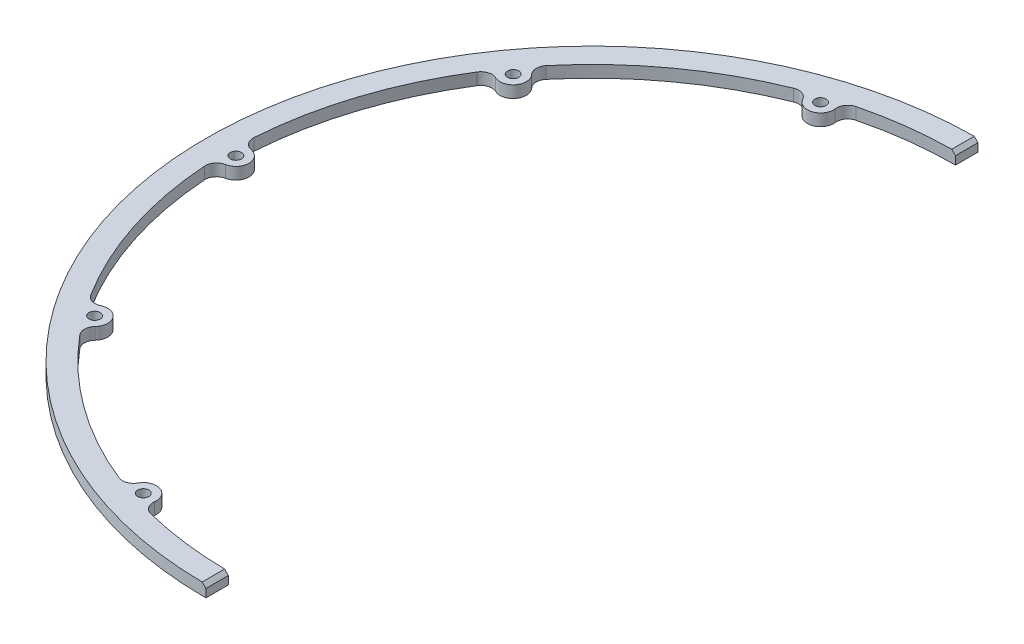
ISO-10303-21;
HEADER;
FILE_DESCRIPTION(('STEP AP214'),'2;1');
FILE_NAME('part.step','',(''),(''),'','','');
FILE_SCHEMA(('AUTOMOTIVE_DESIGN { 1 0 10303 214 1 1 1 1 }'));
ENDSEC;
DATA;
#1=APPLICATION_CONTEXT('core data for automotive mechanical design processes');
#2=APPLICATION_PROTOCOL_DEFINITION('international standard','automotive_design',2000,#1);
#3=PRODUCT_CONTEXT('',#1,'mechanical');
#4=PRODUCT('Part','Part','',(#3));
#5=PRODUCT_RELATED_PRODUCT_CATEGORY('part','',(#4));
#6=PRODUCT_DEFINITION_FORMATION('','',#4);
#7=PRODUCT_DEFINITION_CONTEXT('part definition',#1,'design');
#8=PRODUCT_DEFINITION('design','',#6,#7);
#9=PRODUCT_DEFINITION_SHAPE('','',#8);
#10=(LENGTH_UNIT() NAMED_UNIT(*) SI_UNIT(.MILLI.,.METRE.));
#11=(NAMED_UNIT(*) PLANE_ANGLE_UNIT() SI_UNIT($,.RADIAN.));
#12=(NAMED_UNIT(*) SI_UNIT($,.STERADIAN.) SOLID_ANGLE_UNIT());
#13=UNCERTAINTY_MEASURE_WITH_UNIT(LENGTH_MEASURE(1.E-05),#10,'distance_accuracy_value','');
#14=(GEOMETRIC_REPRESENTATION_CONTEXT(3) GLOBAL_UNCERTAINTY_ASSIGNED_CONTEXT((#13)) GLOBAL_UNIT_ASSIGNED_CONTEXT((#10,
#11,#12)) REPRESENTATION_CONTEXT('',''));
#15=CARTESIAN_POINT('',(0.,0.,0.));
#16=DIRECTION('',(0.,0.,1.));
#17=DIRECTION('',(1.,0.,0.));
#18=AXIS2_PLACEMENT_3D('',#15,#16,#17);
#19=CARTESIAN_POINT('',(0.,3.18000000000001,0.));
#20=DIRECTION('',(0.,-1.,0.));
#21=DIRECTION('',(0.,0.,-1.));
#22=AXIS2_PLACEMENT_3D('',#19,#20,#21);
#23=CYLINDRICAL_SURFACE('',#22,97.);
#24=CARTESIAN_POINT('',(0.,3.18000000000001,0.));
#25=DIRECTION('',(0.,-1.,0.));
#26=DIRECTION('',(0.,0.,1.));
#27=AXIS2_PLACEMENT_3D('',#24,#25,#26);
#28=CIRCLE('',#27,97.);
#29=CARTESIAN_POINT('',(-0.999999999999966,3.18000000000001,96.9948452238571));
#30=VERTEX_POINT('',#29);
#31=CARTESIAN_POINT('',(-23.6390861479454,3.18000000000001,94.075467610265));
#32=VERTEX_POINT('',#31);
#33=EDGE_CURVE('E252',#30,#32,#28,.T.);
#34=ORIENTED_EDGE('',*,*,#33,.F.);
#35=CARTESIAN_POINT('',(0.,2.18000000000001,0.));
#36=DIRECTION('',(0.707106781186557,0.707106781186537,0.));
#37=DIRECTION('',(0.707106781186538,-0.707106781186558,0.));
#38=AXIS2_PLACEMENT_3D('',#35,#36,#37);
#39=ELLIPSE('',#38,137.178715550192,97.);
#40=CARTESIAN_POINT('',(0.,2.18000000000001,97.));
#41=VERTEX_POINT('',#40);
#42=EDGE_CURVE('E56',#30,#41,#39,.T.);
#43=ORIENTED_EDGE('',*,*,#42,.T.);
#44=DIRECTION('',(0.,-1.,0.));
#45=VECTOR('',#44,1.);
#46=CARTESIAN_POINT('',(0.,3.18000000000001,97.));
#47=LINE('',#46,#45);
#48=CARTESIAN_POINT('',(0.,0.,97.));
#49=VERTEX_POINT('',#48);
#50=EDGE_CURVE('E230',#41,#49,#47,.T.);
#51=ORIENTED_EDGE('',*,*,#50,.T.);
#52=CARTESIAN_POINT('',(0.,0.,0.));
#53=DIRECTION('',(0.,-1.,0.));
#54=DIRECTION('',(0.,0.,1.));
#55=AXIS2_PLACEMENT_3D('',#52,#53,#54);
#56=CIRCLE('',#55,97.);
#57=CARTESIAN_POINT('',(-23.6390861479454,0.,94.075467610265));
#58=VERTEX_POINT('',#57);
#59=EDGE_CURVE('E239',#49,#58,#56,.T.);
#60=ORIENTED_EDGE('',*,*,#59,.T.);
#61=DIRECTION('',(0.,-1.,0.));
#62=VECTOR('',#61,1.);
#63=CARTESIAN_POINT('',(-23.6390861479454,3.18000000000001,94.075467610265));
#64=LINE('',#63,#62);
#65=EDGE_CURVE('E345',#58,#32,#64,.F.);
#66=ORIENTED_EDGE('',*,*,#65,.T.);
#67=EDGE_LOOP('',(#34,#43,#51,#60,#66));
#68=FACE_BOUND('',#67,.T.);
#69=ADVANCED_FACE('F47',(#68),#23,.F.);
#70=CARTESIAN_POINT('',(-36.1717500386503,3.18000000000001,90.0033582659081));
#71=VERTEX_POINT('',#70);
#72=CARTESIAN_POINT('',(-74.4205948890133,3.18000000000001,62.2139458350406));
#73=VERTEX_POINT('',#72);
#74=EDGE_CURVE('E461',#71,#73,#28,.T.);
#75=ORIENTED_EDGE('',*,*,#74,.F.);
#76=DIRECTION('',(0.,-1.,0.));
#77=VECTOR('',#76,1.);
#78=CARTESIAN_POINT('',(-36.1717500386503,3.18000000000001,90.0033582659081));
#79=LINE('',#78,#77);
#80=CARTESIAN_POINT('',(-36.1717500386503,0.,90.0033582659081));
#81=VERTEX_POINT('',#80);
#82=EDGE_CURVE('E343',#71,#81,#79,.T.);
#83=ORIENTED_EDGE('',*,*,#82,.T.);
#84=CARTESIAN_POINT('',(-74.4205948890133,0.,62.2139458350406));
#85=VERTEX_POINT('',#84);
#86=EDGE_CURVE('E257',#81,#85,#56,.T.);
#87=ORIENTED_EDGE('',*,*,#86,.T.);
#88=DIRECTION('',(0.,-1.,0.));
#89=VECTOR('',#88,1.);
#90=CARTESIAN_POINT('',(-74.4205948890133,3.18000000000001,62.2139458350406));
#91=LINE('',#90,#89);
#92=EDGE_CURVE('E326',#85,#73,#91,.F.);
#93=ORIENTED_EDGE('',*,*,#92,.T.);
#94=EDGE_LOOP('',(#75,#83,#87,#93));
#95=FACE_BOUND('',#94,.T.);
#96=ADVANCED_FACE('F432',(#95),#23,.F.);
#97=CARTESIAN_POINT('',(-74.4205948890133,0.,-62.2139458350406));
#98=VERTEX_POINT('',#97);
#99=CARTESIAN_POINT('',(-36.1717500386503,1.11022302462516E-13,-90.0033582659081));
#100=VERTEX_POINT('',#99);
#101=EDGE_CURVE('E391',#98,#100,#56,.T.);
#102=ORIENTED_EDGE('',*,*,#101,.T.);
#103=DIRECTION('',(0.,-1.,0.));
#104=VECTOR('',#103,1.);
#105=CARTESIAN_POINT('',(-36.1717500386503,3.18000000000007,-90.0033582659081));
#106=LINE('',#105,#104);
#107=CARTESIAN_POINT('',(-36.1717500386503,3.18000000000007,-90.0033582659081));
#108=VERTEX_POINT('',#107);
#109=EDGE_CURVE('E308',#100,#108,#106,.F.);
#110=ORIENTED_EDGE('',*,*,#109,.T.);
#111=CARTESIAN_POINT('',(-74.4205948890133,3.17999999999996,-62.2139458350406));
#112=VERTEX_POINT('',#111);
#113=EDGE_CURVE('E383',#112,#108,#28,.T.);
#114=ORIENTED_EDGE('',*,*,#113,.F.);
#115=DIRECTION('',(0.,-1.,0.));
#116=VECTOR('',#115,1.);
#117=CARTESIAN_POINT('',(-74.4205948890133,3.17999999999996,-62.2139458350406));
#118=LINE('',#117,#116);
#119=EDGE_CURVE('E288',#112,#98,#118,.T.);
#120=ORIENTED_EDGE('',*,*,#119,.T.);
#121=EDGE_LOOP('',(#102,#110,#114,#120));
#122=FACE_BOUND('',#121,.T.);
#123=ADVANCED_FACE('F437',(#122),#23,.F.);
#124=CARTESIAN_POINT('',(-96.7759658454647,0.,-6.58881132507563));
#125=VERTEX_POINT('',#124);
#126=CARTESIAN_POINT('',(-82.1662071430474,0.,-51.5530251656081));
#127=VERTEX_POINT('',#126);
#128=EDGE_CURVE('E258',#125,#127,#56,.T.);
#129=ORIENTED_EDGE('',*,*,#128,.T.);
#130=DIRECTION('',(0.,-1.,0.));
#131=VECTOR('',#130,1.);
#132=CARTESIAN_POINT('',(-82.1662071430474,3.17999999999996,-51.5530251656081));
#133=LINE('',#132,#131);
#134=CARTESIAN_POINT('',(-82.1662071430474,3.17999999999996,-51.5530251656081));
#135=VERTEX_POINT('',#134);
#136=EDGE_CURVE('E290',#127,#135,#133,.F.);
#137=ORIENTED_EDGE('',*,*,#136,.T.);
#138=CARTESIAN_POINT('',(-96.7759658454647,3.18000000000001,-6.58881132507563));
#139=VERTEX_POINT('',#138);
#140=EDGE_CURVE('E462',#139,#135,#28,.T.);
#141=ORIENTED_EDGE('',*,*,#140,.F.);
#142=DIRECTION('',(0.,-1.,0.));
#143=VECTOR('',#142,1.);
#144=CARTESIAN_POINT('',(-96.7759658454647,3.18000000000001,-6.58881132507563));
#145=LINE('',#144,#143);
#146=EDGE_CURVE('E269',#139,#125,#145,.T.);
#147=ORIENTED_EDGE('',*,*,#146,.T.);
#148=EDGE_LOOP('',(#129,#137,#141,#147));
#149=FACE_BOUND('',#148,.T.);
#150=ADVANCED_FACE('F448',(#149),#23,.F.);
#151=CARTESIAN_POINT('',(-82.1662071430474,3.18000000000001,51.553025165608));
#152=VERTEX_POINT('',#151);
#153=CARTESIAN_POINT('',(-96.7759658454647,3.18000000000001,6.58881132507561));
#154=VERTEX_POINT('',#153);
#155=EDGE_CURVE('E384',#152,#154,#28,.T.);
#156=ORIENTED_EDGE('',*,*,#155,.F.);
#157=DIRECTION('',(0.,-1.,0.));
#158=VECTOR('',#157,1.);
#159=CARTESIAN_POINT('',(-82.1662071430474,3.18000000000001,51.553025165608));
#160=LINE('',#159,#158);
#161=CARTESIAN_POINT('',(-82.1662071430474,0.,51.553025165608));
#162=VERTEX_POINT('',#161);
#163=EDGE_CURVE('E324',#152,#162,#160,.T.);
#164=ORIENTED_EDGE('',*,*,#163,.T.);
#165=CARTESIAN_POINT('',(-96.7759658454647,0.,6.58881132507561));
#166=VERTEX_POINT('',#165);
#167=EDGE_CURVE('E392',#162,#166,#56,.T.);
#168=ORIENTED_EDGE('',*,*,#167,.T.);
#169=DIRECTION('',(0.,-1.,0.));
#170=VECTOR('',#169,1.);
#171=CARTESIAN_POINT('',(-96.7759658454647,3.18000000000001,6.58881132507561));
#172=LINE('',#171,#170);
#173=EDGE_CURVE('E271',#166,#154,#172,.F.);
#174=ORIENTED_EDGE('',*,*,#173,.T.);
#175=EDGE_LOOP('',(#156,#164,#168,#174));
#176=FACE_BOUND('',#175,.T.);
#177=ADVANCED_FACE('F442',(#176),#23,.F.);
#178=CARTESIAN_POINT('',(0.,3.18000000000001,0.));
#179=DIRECTION('',(0.,-1.,0.));
#180=DIRECTION('',(0.,0.,-1.));
#181=AXIS2_PLACEMENT_3D('',#178,#179,#180);
#182=CYLINDRICAL_SURFACE('',#181,103.);
#183=CARTESIAN_POINT('',(0.,3.18000000000001,0.));
#184=DIRECTION('',(0.,1.,0.));
#185=DIRECTION('',(0.,0.,1.));
#186=AXIS2_PLACEMENT_3D('',#183,#184,#185);
#187=CIRCLE('',#186,103.);
#188=CARTESIAN_POINT('',(-0.999999999999973,3.18000000000007,-102.99514551667));
#189=VERTEX_POINT('',#188);
#190=CARTESIAN_POINT('',(-0.999999999999966,3.18000000000001,102.99514551667));
#191=VERTEX_POINT('',#190);
#192=EDGE_CURVE('E260',#189,#191,#187,.T.);
#193=ORIENTED_EDGE('',*,*,#192,.F.);
#194=CARTESIAN_POINT('',(0.,2.18000000000001,0.));
#195=DIRECTION('',(0.707106781186557,0.707106781186537,0.));
#196=DIRECTION('',(0.707106781186538,-0.707106781186558,0.));
#197=AXIS2_PLACEMENT_3D('',#194,#195,#196);
#198=ELLIPSE('',#197,145.663996924431,103.);
#199=CARTESIAN_POINT('',(0.,2.18000000000007,-103.));
#200=VERTEX_POINT('',#199);
#201=EDGE_CURVE('E364',#189,#200,#198,.F.);
#202=ORIENTED_EDGE('',*,*,#201,.T.);
#203=DIRECTION('',(0.,-1.,0.));
#204=VECTOR('',#203,1.);
#205=CARTESIAN_POINT('',(0.,3.18000000000007,-103.));
#206=LINE('',#205,#204);
#207=CARTESIAN_POINT('',(0.,1.11022302462516E-13,-103.));
#208=VERTEX_POINT('',#207);
#209=EDGE_CURVE('E244',#200,#208,#206,.T.);
#210=ORIENTED_EDGE('',*,*,#209,.T.);
#211=CARTESIAN_POINT('',(0.,0.,0.));
#212=DIRECTION('',(0.,1.,0.));
#213=DIRECTION('',(0.,0.,1.));
#214=AXIS2_PLACEMENT_3D('',#211,#212,#213);
#215=CIRCLE('',#214,103.);
#216=CARTESIAN_POINT('',(0.,0.,103.));
#217=VERTEX_POINT('',#216);
#218=EDGE_CURVE('E237',#208,#217,#215,.T.);
#219=ORIENTED_EDGE('',*,*,#218,.T.);
#220=DIRECTION('',(0.,-1.,0.));
#221=VECTOR('',#220,1.);
#222=CARTESIAN_POINT('',(0.,3.18000000000001,103.));
#223=LINE('',#222,#221);
#224=CARTESIAN_POINT('',(0.,2.18000000000001,103.));
#225=VERTEX_POINT('',#224);
#226=EDGE_CURVE('E220',#225,#217,#223,.T.);
#227=ORIENTED_EDGE('',*,*,#226,.F.);
#228=CARTESIAN_POINT('',(0.,2.18000000000001,0.));
#229=DIRECTION('',(0.707106781186557,0.707106781186537,0.));
#230=DIRECTION('',(0.707106781186538,-0.707106781186558,0.));
#231=AXIS2_PLACEMENT_3D('',#228,#229,#230);
#232=ELLIPSE('',#231,145.663996924431,103.);
#233=EDGE_CURVE('E362',#225,#191,#232,.F.);
#234=ORIENTED_EDGE('',*,*,#233,.T.);
#235=EDGE_LOOP('',(#193,#202,#210,#219,#227,#234));
#236=FACE_BOUND('',#235,.T.);
#237=ADVANCED_FACE('F243',(#236),#182,.T.);
#238=CARTESIAN_POINT('',(0.,3.18000000000001,97.));
#239=DIRECTION('',(-1.,0.,0.));
#240=DIRECTION('',(0.,0.,1.));
#241=AXIS2_PLACEMENT_3D('',#238,#239,#240);
#242=PLANE('',#241);
#243=ORIENTED_EDGE('',*,*,#50,.F.);
#244=DIRECTION('',(0.,0.,1.));
#245=VECTOR('',#244,1.);
#246=CARTESIAN_POINT('',(0.,2.18000000000001,103.));
#247=LINE('',#246,#245);
#248=EDGE_CURVE('E11',#41,#225,#247,.T.);
#249=ORIENTED_EDGE('',*,*,#248,.T.);
#250=ORIENTED_EDGE('',*,*,#226,.T.);
#251=DIRECTION('',(0.,0.,-1.));
#252=VECTOR('',#251,1.);
#253=CARTESIAN_POINT('',(0.,0.,97.));
#254=LINE('',#253,#252);
#255=EDGE_CURVE('E223',#217,#49,#254,.T.);
#256=ORIENTED_EDGE('',*,*,#255,.T.);
#257=EDGE_LOOP('',(#243,#249,#250,#256));
#258=FACE_BOUND('',#257,.T.);
#259=ADVANCED_FACE('F222',(#258),#242,.F.);
#260=DIRECTION('',(0.,-1.,0.));
#261=VECTOR('',#260,1.);
#262=CARTESIAN_POINT('',(0.,3.18000000000007,-97.));
#263=LINE('',#262,#261);
#264=CARTESIAN_POINT('',(0.,2.18000000000007,-97.));
#265=VERTEX_POINT('',#264);
#266=CARTESIAN_POINT('',(0.,1.11022302462516E-13,-97.));
#267=VERTEX_POINT('',#266);
#268=EDGE_CURVE('E262',#265,#267,#263,.T.);
#269=ORIENTED_EDGE('',*,*,#268,.F.);
#270=CARTESIAN_POINT('',(0.,2.18000000000001,0.));
#271=DIRECTION('',(0.707106781186557,0.707106781186537,0.));
#272=DIRECTION('',(0.707106781186538,-0.707106781186558,0.));
#273=AXIS2_PLACEMENT_3D('',#270,#271,#272);
#274=ELLIPSE('',#273,137.178715550192,97.);
#275=CARTESIAN_POINT('',(-0.999999999999973,3.18000000000007,-96.9948452238572));
#276=VERTEX_POINT('',#275);
#277=EDGE_CURVE('E367',#265,#276,#274,.T.);
#278=ORIENTED_EDGE('',*,*,#277,.T.);
#279=CARTESIAN_POINT('',(-23.6390861479453,3.18000000000006,-94.075467610265));
#280=VERTEX_POINT('',#279);
#281=EDGE_CURVE('E373',#280,#276,#28,.T.);
#282=ORIENTED_EDGE('',*,*,#281,.F.);
#283=DIRECTION('',(0.,-1.,0.));
#284=VECTOR('',#283,1.);
#285=CARTESIAN_POINT('',(-23.6390861479453,3.18000000000006,-94.075467610265));
#286=LINE('',#285,#284);
#287=CARTESIAN_POINT('',(-23.6390861479453,1.11022302462516E-13,-94.075467610265));
#288=VERTEX_POINT('',#287);
#289=EDGE_CURVE('E306',#280,#288,#286,.T.);
#290=ORIENTED_EDGE('',*,*,#289,.T.);
#291=EDGE_CURVE('E240',#288,#267,#56,.T.);
#292=ORIENTED_EDGE('',*,*,#291,.T.);
#293=EDGE_LOOP('',(#269,#278,#282,#290,#292));
#294=FACE_BOUND('',#293,.T.);
#295=ADVANCED_FACE('F372',(#294),#23,.F.);
#296=CARTESIAN_POINT('',(0.,3.18000000000007,-103.));
#297=DIRECTION('',(-1.,0.,0.));
#298=DIRECTION('',(0.,0.,1.));
#299=AXIS2_PLACEMENT_3D('',#296,#297,#298);
#300=PLANE('',#299);
#301=ORIENTED_EDGE('',*,*,#209,.F.);
#302=DIRECTION('',(0.,0.,1.));
#303=VECTOR('',#302,1.);
#304=CARTESIAN_POINT('',(0.,2.18000000000007,-97.));
#305=LINE('',#304,#303);
#306=EDGE_CURVE('E70',#200,#265,#305,.T.);
#307=ORIENTED_EDGE('',*,*,#306,.T.);
#308=ORIENTED_EDGE('',*,*,#268,.T.);
#309=DIRECTION('',(0.,0.,-1.));
#310=VECTOR('',#309,1.);
#311=CARTESIAN_POINT('',(0.,1.11022302462516E-13,-103.));
#312=LINE('',#311,#310);
#313=EDGE_CURVE('E256',#267,#208,#312,.T.);
#314=ORIENTED_EDGE('',*,*,#313,.T.);
#315=EDGE_LOOP('',(#301,#307,#308,#314));
#316=FACE_BOUND('',#315,.T.);
#317=ADVANCED_FACE('F386',(#316),#300,.F.);
#318=CARTESIAN_POINT('',(0.,3.18000000000001,0.));
#319=DIRECTION('',(0.,1.,0.));
#320=DIRECTION('',(0.,0.,1.));
#321=AXIS2_PLACEMENT_3D('',#318,#319,#320);
#322=PLANE('',#321);
#323=CARTESIAN_POINT('',(-29.3566144656198,3.18000000000002,90.3503690480397));
#324=DIRECTION('',(0.,1.,0.));
#325=DIRECTION('',(0.951056516295155,0.,0.309016994374945));
#326=AXIS2_PLACEMENT_3D('',#323,#324,#325);
#327=CIRCLE('',#326,1.5);
#328=CARTESIAN_POINT('',(-27.930029691177,3.18000000000002,90.8138945396021));
#329=VERTEX_POINT('',#328);
#330=EDGE_CURVE('E622',#329,#329,#327,.T.);
#331=ORIENTED_EDGE('',*,*,#330,.F.);
#332=EDGE_LOOP('',(#331));
#333=FACE_BOUND('',#332,.T.);
#334=CARTESIAN_POINT('',(-76.8566144656199,3.18000000000002,55.8395989677851));
#335=DIRECTION('',(0.,1.,0.));
#336=DIRECTION('',(0.587785252292474,0.,0.809016994374947));
#337=AXIS2_PLACEMENT_3D('',#334,#335,#336);
#338=CIRCLE('',#337,1.5);
#339=CARTESIAN_POINT('',(-75.9749365871812,3.18000000000002,57.0531244593475));
#340=VERTEX_POINT('',#339);
#341=EDGE_CURVE('E618',#340,#340,#338,.T.);
#342=ORIENTED_EDGE('',*,*,#341,.F.);
#343=EDGE_LOOP('',(#342));
#344=FACE_BOUND('',#343,.T.);
#345=CARTESIAN_POINT('',(-29.3566144656198,3.18000000000007,-90.3503690480398));
#346=DIRECTION('',(0.,1.,0.));
#347=DIRECTION('',(-0.951056516295155,0.,0.309016994374945));
#348=AXIS2_PLACEMENT_3D('',#345,#346,#347);
#349=CIRCLE('',#348,1.5);
#350=CARTESIAN_POINT('',(-30.7831992400625,3.18000000000007,-89.8868435564773));
#351=VERTEX_POINT('',#350);
#352=EDGE_CURVE('E612',#351,#351,#349,.T.);
#353=ORIENTED_EDGE('',*,*,#352,.F.);
#354=EDGE_LOOP('',(#353));
#355=FACE_BOUND('',#354,.T.);
#356=CARTESIAN_POINT('',(-76.8566144656199,3.17999999999996,-55.839598967785));
#357=DIRECTION('',(0.,1.,0.));
#358=DIRECTION('',(-0.587785252292474,0.,0.809016994374947));
#359=AXIS2_PLACEMENT_3D('',#356,#357,#358);
#360=CIRCLE('',#359,1.5);
#361=CARTESIAN_POINT('',(-77.7382923440586,3.17999999999996,-54.6260734762226));
#362=VERTEX_POINT('',#361);
#363=EDGE_CURVE('E498',#362,#362,#360,.T.);
#364=ORIENTED_EDGE('',*,*,#363,.F.);
#365=EDGE_LOOP('',(#364));
#366=FACE_BOUND('',#365,.T.);
#367=ORIENTED_EDGE('',*,*,#281,.T.);
#368=DIRECTION('',(0.,0.,-1.));
#369=VECTOR('',#368,1.);
#370=CARTESIAN_POINT('',(-0.999999999999973,3.18000000000007,-103.));
#371=LINE('',#370,#369);
#372=EDGE_CURVE('E359',#276,#189,#371,.T.);
#373=ORIENTED_EDGE('',*,*,#372,.T.);
#374=ORIENTED_EDGE('',*,*,#192,.T.);
#375=DIRECTION('',(0.,0.,-1.));
#376=VECTOR('',#375,1.);
#377=CARTESIAN_POINT('',(-0.999999999999966,3.18000000000001,96.9999999999999));
#378=LINE('',#377,#376);
#379=EDGE_CURVE('E356',#191,#30,#378,.T.);
#380=ORIENTED_EDGE('',*,*,#379,.T.);
#381=ORIENTED_EDGE('',*,*,#33,.T.);
#382=CARTESIAN_POINT('',(-22.9079803907924,3.18000000000001,91.1659170656177));
#383=DIRECTION('',(0.,1.,0.));
#384=DIRECTION('',(0.,0.,1.));
#385=AXIS2_PLACEMENT_3D('',#382,#383,#384);
#386=CIRCLE('',#385,3.);
#387=CARTESIAN_POINT('',(-25.8842730407127,3.18000000000002,90.7895102882739));
#388=VERTEX_POINT('',#387);
#389=EDGE_CURVE('E352',#32,#388,#386,.F.);
#390=ORIENTED_EDGE('',*,*,#389,.T.);
#391=CARTESIAN_POINT('',(-29.3566144656198,3.18000000000002,90.3503690480397));
#392=DIRECTION('',(0.,1.,0.));
#393=DIRECTION('',(0.951056516295155,0.,0.309016994374945));
#394=AXIS2_PLACEMENT_3D('',#391,#392,#393);
#395=CIRCLE('',#394,3.50000000000001);
#396=CARTESIAN_POINT('',(-32.4239184333248,3.18000000000001,88.6646506938356));
#397=VERTEX_POINT('',#396);
#398=EDGE_CURVE('E489',#388,#397,#395,.T.);
#399=ORIENTED_EDGE('',*,*,#398,.T.);
#400=CARTESIAN_POINT('',(-35.0530361199292,3.18000000000001,87.2197492473748));
#401=DIRECTION('',(0.,1.,0.));
#402=DIRECTION('',(0.,0.,1.));
#403=AXIS2_PLACEMENT_3D('',#400,#401,#402);
#404=CIRCLE('',#403,3.);
#405=EDGE_CURVE('E348',#397,#71,#404,.F.);
#406=ORIENTED_EDGE('',*,*,#405,.T.);
#407=ORIENTED_EDGE('',*,*,#74,.T.);
#408=CARTESIAN_POINT('',(-72.1189270058479,3.18000000000001,60.2898031803487));
#409=DIRECTION('',(0.,1.,0.));
#410=DIRECTION('',(0.,0.,1.));
#411=AXIS2_PLACEMENT_3D('',#408,#409,#410);
#412=CIRCLE('',#411,3.);
#413=CARTESIAN_POINT('',(-74.3055519872811,3.18000000000002,58.2358627745501));
#414=VERTEX_POINT('',#413);
#415=EDGE_CURVE('E333',#73,#414,#412,.F.);
#416=ORIENTED_EDGE('',*,*,#415,.T.);
#417=CARTESIAN_POINT('',(-76.8566144656199,3.18000000000002,55.8395989677851));
#418=DIRECTION('',(0.,1.,0.));
#419=DIRECTION('',(0.587785252292474,0.,0.809016994374947));
#420=AXIS2_PLACEMENT_3D('',#417,#418,#419);
#421=CIRCLE('',#420,3.50000000000001);
#422=CARTESIAN_POINT('',(-78.3472751142871,3.18000000000001,52.6729081349889));
#423=VERTEX_POINT('',#422);
#424=EDGE_CURVE('E408',#414,#423,#421,.T.);
#425=ORIENTED_EDGE('',*,*,#424,.T.);
#426=CARTESIAN_POINT('',(-79.6249842417161,3.18000000000001,49.9586017068779));
#427=DIRECTION('',(0.,1.,0.));
#428=DIRECTION('',(0.,0.,1.));
#429=AXIS2_PLACEMENT_3D('',#426,#427,#428);
#430=CIRCLE('',#429,3.);
#431=EDGE_CURVE('E329',#423,#152,#430,.F.);
#432=ORIENTED_EDGE('',*,*,#431,.T.);
#433=ORIENTED_EDGE('',*,*,#155,.T.);
#434=CARTESIAN_POINT('',(-93.7828947368421,3.18000000000001,6.38503365522788));
#435=DIRECTION('',(0.,1.,0.));
#436=DIRECTION('',(0.,0.,1.));
#437=AXIS2_PLACEMENT_3D('',#434,#435,#436);
#438=CIRCLE('',#437,3.);
#439=CARTESIAN_POINT('',(-94.3446356275303,3.18000000000001,3.43809504512271));
#440=VERTEX_POINT('',#439);
#441=EDGE_CURVE('E278',#154,#440,#438,.F.);
#442=ORIENTED_EDGE('',*,*,#441,.T.);
#443=CARTESIAN_POINT('',(-95.,3.18000000000001,0.));
#444=DIRECTION('',(0.,1.,0.));
#445=DIRECTION('',(0.,0.,1.));
#446=AXIS2_PLACEMENT_3D('',#443,#444,#445);
#447=CIRCLE('',#446,3.50000000000001);
#448=CARTESIAN_POINT('',(-94.3446356275303,3.18000000000001,-3.43809504512274));
#449=VERTEX_POINT('',#448);
#450=EDGE_CURVE('E249',#440,#449,#447,.T.);
#451=ORIENTED_EDGE('',*,*,#450,.T.);
#452=CARTESIAN_POINT('',(-93.782894736842,3.18000000000001,-6.38503365522794));
#453=DIRECTION('',(0.,1.,0.));
#454=DIRECTION('',(0.,0.,1.));
#455=AXIS2_PLACEMENT_3D('',#452,#453,#454);
#456=CIRCLE('',#455,3.);
#457=EDGE_CURVE('E274',#449,#139,#456,.F.);
#458=ORIENTED_EDGE('',*,*,#457,.T.);
#459=ORIENTED_EDGE('',*,*,#140,.T.);
#460=CARTESIAN_POINT('',(-79.624984241716,3.17999999999996,-49.958601706878));
#461=DIRECTION('',(0.,1.,0.));
#462=DIRECTION('',(0.,0.,1.));
#463=AXIS2_PLACEMENT_3D('',#460,#461,#462);
#464=CIRCLE('',#463,3.);
#465=CARTESIAN_POINT('',(-78.3472751142871,3.17999999999996,-52.6729081349888));
#466=VERTEX_POINT('',#465);
#467=EDGE_CURVE('E297',#135,#466,#464,.F.);
#468=ORIENTED_EDGE('',*,*,#467,.T.);
#469=CARTESIAN_POINT('',(-76.8566144656199,3.17999999999996,-55.839598967785));
#470=DIRECTION('',(0.,1.,0.));
#471=DIRECTION('',(-0.587785252292474,0.,0.809016994374947));
#472=AXIS2_PLACEMENT_3D('',#469,#470,#471);
#473=CIRCLE('',#472,3.50000000000001);
#474=CARTESIAN_POINT('',(-74.3055519872811,3.17999999999996,-58.2358627745501));
#475=VERTEX_POINT('',#474);
#476=EDGE_CURVE('E405',#466,#475,#473,.T.);
#477=ORIENTED_EDGE('',*,*,#476,.T.);
#478=CARTESIAN_POINT('',(-72.1189270058479,3.17999999999996,-60.2898031803486));
#479=DIRECTION('',(0.,1.,0.));
#480=DIRECTION('',(0.,0.,1.));
#481=AXIS2_PLACEMENT_3D('',#478,#479,#480);
#482=CIRCLE('',#481,3.);
#483=EDGE_CURVE('E293',#475,#112,#482,.F.);
#484=ORIENTED_EDGE('',*,*,#483,.T.);
#485=ORIENTED_EDGE('',*,*,#113,.T.);
#486=CARTESIAN_POINT('',(-35.0530361199291,3.18000000000007,-87.2197492473748));
#487=DIRECTION('',(0.,1.,0.));
#488=DIRECTION('',(0.,0.,1.));
#489=AXIS2_PLACEMENT_3D('',#486,#487,#488);
#490=CIRCLE('',#489,3.);
#491=CARTESIAN_POINT('',(-32.4239184333248,3.18000000000007,-88.6646506938356));
#492=VERTEX_POINT('',#491);
#493=EDGE_CURVE('E315',#108,#492,#490,.F.);
#494=ORIENTED_EDGE('',*,*,#493,.T.);
#495=CARTESIAN_POINT('',(-29.3566144656198,3.18000000000007,-90.3503690480398));
#496=DIRECTION('',(0.,1.,0.));
#497=DIRECTION('',(-0.951056516295155,0.,0.309016994374945));
#498=AXIS2_PLACEMENT_3D('',#495,#496,#497);
#499=CIRCLE('',#498,3.50000000000001);
#500=CARTESIAN_POINT('',(-25.8842730407127,3.18000000000007,-90.789510288274));
#501=VERTEX_POINT('',#500);
#502=EDGE_CURVE('E399',#492,#501,#499,.T.);
#503=ORIENTED_EDGE('',*,*,#502,.T.);
#504=CARTESIAN_POINT('',(-22.9079803907924,3.18000000000006,-91.1659170656176));
#505=DIRECTION('',(0.,1.,0.));
#506=DIRECTION('',(0.,0.,1.));
#507=AXIS2_PLACEMENT_3D('',#504,#505,#506);
#508=CIRCLE('',#507,3.);
#509=EDGE_CURVE('E311',#501,#280,#508,.F.);
#510=ORIENTED_EDGE('',*,*,#509,.T.);
#511=EDGE_LOOP('',(#367,#373,#374,#380,#381,#390,#399,#406,#407,#416,#425,#432,#433,#442,#451,
#458,#459,#468,#477,#484,#485,#494,#503,#510));
#512=FACE_BOUND('',#511,.T.);
#513=CARTESIAN_POINT('',(-95.,3.18000000000001,0.));
#514=DIRECTION('',(0.,1.,0.));
#515=DIRECTION('',(0.,0.,1.));
#516=AXIS2_PLACEMENT_3D('',#513,#514,#515);
#517=CIRCLE('',#516,1.5);
#518=CARTESIAN_POINT('',(-95.,3.18000000000001,1.49999999999997));
#519=VERTEX_POINT('',#518);
#520=EDGE_CURVE('E415',#519,#519,#517,.T.);
#521=ORIENTED_EDGE('',*,*,#520,.F.);
#522=EDGE_LOOP('',(#521));
#523=FACE_BOUND('',#522,.T.);
#524=ADVANCED_FACE('F379',(#333,#344,#355,#366,#512,#523),#322,.T.);
#525=CARTESIAN_POINT('',(0.,0.,0.));
#526=DIRECTION('',(0.,1.,0.));
#527=DIRECTION('',(0.,0.,1.));
#528=AXIS2_PLACEMENT_3D('',#525,#526,#527);
#529=PLANE('',#528);
#530=CARTESIAN_POINT('',(-29.3566144656198,0.,90.3503690480397));
#531=DIRECTION('',(0.,1.,0.));
#532=DIRECTION('',(0.,0.,1.));
#533=AXIS2_PLACEMENT_3D('',#530,#531,#532);
#534=CIRCLE('',#533,1.5);
#535=CARTESIAN_POINT('',(-29.3566144656198,0.,91.8503690480397));
#536=VERTEX_POINT('',#535);
#537=EDGE_CURVE('E598',#536,#536,#534,.F.);
#538=ORIENTED_EDGE('',*,*,#537,.F.);
#539=EDGE_LOOP('',(#538));
#540=FACE_BOUND('',#539,.T.);
#541=CARTESIAN_POINT('',(-76.8566144656199,0.,55.8395989677851));
#542=DIRECTION('',(0.,1.,0.));
#543=DIRECTION('',(0.,0.,1.));
#544=AXIS2_PLACEMENT_3D('',#541,#542,#543);
#545=CIRCLE('',#544,1.5);
#546=CARTESIAN_POINT('',(-76.8566144656199,0.,57.3395989677851));
#547=VERTEX_POINT('',#546);
#548=EDGE_CURVE('E602',#547,#547,#545,.F.);
#549=ORIENTED_EDGE('',*,*,#548,.F.);
#550=EDGE_LOOP('',(#549));
#551=FACE_BOUND('',#550,.T.);
#552=CARTESIAN_POINT('',(-29.3566144656198,1.11022302462516E-13,-90.3503690480398));
#553=DIRECTION('',(0.,1.,0.));
#554=DIRECTION('',(0.,0.,1.));
#555=AXIS2_PLACEMENT_3D('',#552,#553,#554);
#556=CIRCLE('',#555,1.5);
#557=CARTESIAN_POINT('',(-29.3566144656198,1.11022302462516E-13,-88.8503690480398));
#558=VERTEX_POINT('',#557);
#559=EDGE_CURVE('E606',#558,#558,#556,.F.);
#560=ORIENTED_EDGE('',*,*,#559,.F.);
#561=EDGE_LOOP('',(#560));
#562=FACE_BOUND('',#561,.T.);
#563=CARTESIAN_POINT('',(-76.8566144656199,0.,-55.839598967785));
#564=DIRECTION('',(0.,1.,0.));
#565=DIRECTION('',(0.,0.,1.));
#566=AXIS2_PLACEMENT_3D('',#563,#564,#565);
#567=CIRCLE('',#566,1.5);
#568=CARTESIAN_POINT('',(-76.8566144656199,0.,-54.339598967785));
#569=VERTEX_POINT('',#568);
#570=EDGE_CURVE('E494',#569,#569,#567,.F.);
#571=ORIENTED_EDGE('',*,*,#570,.F.);
#572=EDGE_LOOP('',(#571));
#573=FACE_BOUND('',#572,.T.);
#574=CARTESIAN_POINT('',(-95.,0.,0.));
#575=DIRECTION('',(0.,1.,0.));
#576=DIRECTION('',(0.,0.,1.));
#577=AXIS2_PLACEMENT_3D('',#574,#575,#576);
#578=CIRCLE('',#577,1.5);
#579=CARTESIAN_POINT('',(-95.,0.,1.49999999999997));
#580=VERTEX_POINT('',#579);
#581=EDGE_CURVE('E420',#580,#580,#578,.F.);
#582=ORIENTED_EDGE('',*,*,#581,.F.);
#583=EDGE_LOOP('',(#582));
#584=FACE_BOUND('',#583,.T.);
#585=ORIENTED_EDGE('',*,*,#86,.F.);
#586=CARTESIAN_POINT('',(-35.0530361199292,0.,87.2197492473748));
#587=DIRECTION('',(0.,1.,0.));
#588=DIRECTION('',(0.,0.,1.));
#589=AXIS2_PLACEMENT_3D('',#586,#587,#588);
#590=CIRCLE('',#589,3.);
#591=CARTESIAN_POINT('',(-32.4239184333248,0.,88.6646506938356));
#592=VERTEX_POINT('',#591);
#593=EDGE_CURVE('E350',#81,#592,#590,.T.);
#594=ORIENTED_EDGE('',*,*,#593,.T.);
#595=CARTESIAN_POINT('',(-29.3566144656198,0.,90.3503690480397));
#596=DIRECTION('',(0.,1.,0.));
#597=DIRECTION('',(0.,0.,1.));
#598=AXIS2_PLACEMENT_3D('',#595,#596,#597);
#599=CIRCLE('',#598,3.50000000000001);
#600=CARTESIAN_POINT('',(-25.8842730407127,0.,90.7895102882739));
#601=VERTEX_POINT('',#600);
#602=EDGE_CURVE('E491',#592,#601,#599,.F.);
#603=ORIENTED_EDGE('',*,*,#602,.T.);
#604=CARTESIAN_POINT('',(-22.9079803907924,0.,91.1659170656177));
#605=DIRECTION('',(0.,1.,0.));
#606=DIRECTION('',(0.,0.,1.));
#607=AXIS2_PLACEMENT_3D('',#604,#605,#606);
#608=CIRCLE('',#607,3.);
#609=EDGE_CURVE('E354',#601,#58,#608,.T.);
#610=ORIENTED_EDGE('',*,*,#609,.T.);
#611=ORIENTED_EDGE('',*,*,#59,.F.);
#612=ORIENTED_EDGE('',*,*,#255,.F.);
#613=ORIENTED_EDGE('',*,*,#218,.F.);
#614=ORIENTED_EDGE('',*,*,#313,.F.);
#615=ORIENTED_EDGE('',*,*,#291,.F.);
#616=CARTESIAN_POINT('',(-22.9079803907924,1.11022302462516E-13,-91.1659170656176));
#617=DIRECTION('',(0.,1.,0.));
#618=DIRECTION('',(0.,0.,1.));
#619=AXIS2_PLACEMENT_3D('',#616,#617,#618);
#620=CIRCLE('',#619,3.);
#621=CARTESIAN_POINT('',(-25.8842730407127,1.11022302462516E-13,-90.789510288274));
#622=VERTEX_POINT('',#621);
#623=EDGE_CURVE('E313',#288,#622,#620,.T.);
#624=ORIENTED_EDGE('',*,*,#623,.T.);
#625=CARTESIAN_POINT('',(-29.3566144656198,1.11022302462516E-13,-90.3503690480398));
#626=DIRECTION('',(0.,1.,0.));
#627=DIRECTION('',(0.,0.,1.));
#628=AXIS2_PLACEMENT_3D('',#625,#626,#627);
#629=CIRCLE('',#628,3.50000000000001);
#630=CARTESIAN_POINT('',(-32.4239184333248,1.11022302462516E-13,-88.6646506938356));
#631=VERTEX_POINT('',#630);
#632=EDGE_CURVE('E401',#622,#631,#629,.F.);
#633=ORIENTED_EDGE('',*,*,#632,.T.);
#634=CARTESIAN_POINT('',(-35.0530361199291,1.11022302462516E-13,-87.2197492473748));
#635=DIRECTION('',(0.,1.,0.));
#636=DIRECTION('',(0.,0.,1.));
#637=AXIS2_PLACEMENT_3D('',#634,#635,#636);
#638=CIRCLE('',#637,3.);
#639=EDGE_CURVE('E317',#631,#100,#638,.T.);
#640=ORIENTED_EDGE('',*,*,#639,.T.);
#641=ORIENTED_EDGE('',*,*,#101,.F.);
#642=CARTESIAN_POINT('',(-72.1189270058479,0.,-60.2898031803486));
#643=DIRECTION('',(0.,1.,0.));
#644=DIRECTION('',(0.,0.,1.));
#645=AXIS2_PLACEMENT_3D('',#642,#643,#644);
#646=CIRCLE('',#645,3.);
#647=CARTESIAN_POINT('',(-74.3055519872811,0.,-58.2358627745501));
#648=VERTEX_POINT('',#647);
#649=EDGE_CURVE('E295',#98,#648,#646,.T.);
#650=ORIENTED_EDGE('',*,*,#649,.T.);
#651=CARTESIAN_POINT('',(-76.8566144656199,0.,-55.839598967785));
#652=DIRECTION('',(0.,1.,0.));
#653=DIRECTION('',(0.,0.,1.));
#654=AXIS2_PLACEMENT_3D('',#651,#652,#653);
#655=CIRCLE('',#654,3.50000000000001);
#656=CARTESIAN_POINT('',(-78.3472751142871,0.,-52.672908134989));
#657=VERTEX_POINT('',#656);
#658=EDGE_CURVE('E412',#648,#657,#655,.F.);
#659=ORIENTED_EDGE('',*,*,#658,.T.);
#660=CARTESIAN_POINT('',(-79.624984241716,0.,-49.958601706878));
#661=DIRECTION('',(0.,1.,0.));
#662=DIRECTION('',(0.,0.,1.));
#663=AXIS2_PLACEMENT_3D('',#660,#661,#662);
#664=CIRCLE('',#663,3.);
#665=EDGE_CURVE('E299',#657,#127,#664,.T.);
#666=ORIENTED_EDGE('',*,*,#665,.T.);
#667=ORIENTED_EDGE('',*,*,#128,.F.);
#668=CARTESIAN_POINT('',(-93.782894736842,0.,-6.38503365522794));
#669=DIRECTION('',(0.,1.,0.));
#670=DIRECTION('',(0.,0.,1.));
#671=AXIS2_PLACEMENT_3D('',#668,#669,#670);
#672=CIRCLE('',#671,3.);
#673=CARTESIAN_POINT('',(-94.3446356275303,0.,-3.43809504512274));
#674=VERTEX_POINT('',#673);
#675=EDGE_CURVE('E276',#125,#674,#672,.T.);
#676=ORIENTED_EDGE('',*,*,#675,.T.);
#677=CARTESIAN_POINT('',(-95.,0.,0.));
#678=DIRECTION('',(0.,1.,0.));
#679=DIRECTION('',(0.,0.,1.));
#680=AXIS2_PLACEMENT_3D('',#677,#678,#679);
#681=CIRCLE('',#680,3.50000000000001);
#682=CARTESIAN_POINT('',(-94.3446356275303,0.,3.43809504512271));
#683=VERTEX_POINT('',#682);
#684=EDGE_CURVE('E246',#674,#683,#681,.F.);
#685=ORIENTED_EDGE('',*,*,#684,.T.);
#686=CARTESIAN_POINT('',(-93.7828947368421,0.,6.38503365522788));
#687=DIRECTION('',(0.,1.,0.));
#688=DIRECTION('',(0.,0.,1.));
#689=AXIS2_PLACEMENT_3D('',#686,#687,#688);
#690=CIRCLE('',#689,3.);
#691=EDGE_CURVE('E280',#683,#166,#690,.T.);
#692=ORIENTED_EDGE('',*,*,#691,.T.);
#693=ORIENTED_EDGE('',*,*,#167,.F.);
#694=CARTESIAN_POINT('',(-79.6249842417161,0.,49.9586017068779));
#695=DIRECTION('',(0.,1.,0.));
#696=DIRECTION('',(0.,0.,1.));
#697=AXIS2_PLACEMENT_3D('',#694,#695,#696);
#698=CIRCLE('',#697,3.);
#699=CARTESIAN_POINT('',(-78.3472751142871,0.,52.6729081349889));
#700=VERTEX_POINT('',#699);
#701=EDGE_CURVE('E331',#162,#700,#698,.T.);
#702=ORIENTED_EDGE('',*,*,#701,.T.);
#703=CARTESIAN_POINT('',(-76.8566144656199,0.,55.8395989677851));
#704=DIRECTION('',(0.,1.,0.));
#705=DIRECTION('',(0.,0.,1.));
#706=AXIS2_PLACEMENT_3D('',#703,#704,#705);
#707=CIRCLE('',#706,3.50000000000001);
#708=CARTESIAN_POINT('',(-74.3055519872811,0.,58.2358627745501));
#709=VERTEX_POINT('',#708);
#710=EDGE_CURVE('E403',#700,#709,#707,.F.);
#711=ORIENTED_EDGE('',*,*,#710,.T.);
#712=CARTESIAN_POINT('',(-72.1189270058479,0.,60.2898031803487));
#713=DIRECTION('',(0.,1.,0.));
#714=DIRECTION('',(0.,0.,1.));
#715=AXIS2_PLACEMENT_3D('',#712,#713,#714);
#716=CIRCLE('',#715,3.);
#717=EDGE_CURVE('E335',#709,#85,#716,.T.);
#718=ORIENTED_EDGE('',*,*,#717,.T.);
#719=EDGE_LOOP('',(#585,#594,#603,#610,#611,#612,#613,#614,#615,#624,#633,#640,#641,#650,#659,
#666,#667,#676,#685,#692,#693,#702,#711,#718));
#720=FACE_BOUND('',#719,.T.);
#721=ADVANCED_FACE('F235',(#540,#551,#562,#573,#584,#720),#529,.F.);
#722=CARTESIAN_POINT('',(-95.,-9.89949493661169,0.));
#723=DIRECTION('',(0.,1.,0.));
#724=DIRECTION('',(0.,0.,1.));
#725=AXIS2_PLACEMENT_3D('',#722,#723,#724);
#726=CYLINDRICAL_SURFACE('',#725,3.50000000000001);
#727=ORIENTED_EDGE('',*,*,#684,.F.);
#728=DIRECTION('',(0.,1.,0.));
#729=VECTOR('',#728,1.);
#730=CARTESIAN_POINT('',(-94.3446356275303,-9.89949493661169,-3.43809504512274));
#731=LINE('',#730,#729);
#732=EDGE_CURVE('E266',#674,#449,#731,.T.);
#733=ORIENTED_EDGE('',*,*,#732,.T.);
#734=ORIENTED_EDGE('',*,*,#450,.F.);
#735=DIRECTION('',(0.,1.,0.));
#736=VECTOR('',#735,1.);
#737=CARTESIAN_POINT('',(-94.3446356275303,-9.89949493661169,3.43809504512274));
#738=LINE('',#737,#736);
#739=EDGE_CURVE('E229',#440,#683,#738,.F.);
#740=ORIENTED_EDGE('',*,*,#739,.T.);
#741=EDGE_LOOP('',(#727,#733,#734,#740));
#742=FACE_BOUND('',#741,.T.);
#743=ADVANCED_FACE('F583',(#742),#726,.T.);
#744=CARTESIAN_POINT('',(-93.782894736842,3.18000000000001,-6.38503365522794));
#745=DIRECTION('',(0.,1.,0.));
#746=DIRECTION('',(0.,0.,1.));
#747=AXIS2_PLACEMENT_3D('',#744,#745,#746);
#748=CYLINDRICAL_SURFACE('',#747,3.);
#749=ORIENTED_EDGE('',*,*,#675,.F.);
#750=ORIENTED_EDGE('',*,*,#146,.F.);
#751=ORIENTED_EDGE('',*,*,#457,.F.);
#752=ORIENTED_EDGE('',*,*,#732,.F.);
#753=EDGE_LOOP('',(#749,#750,#751,#752));
#754=FACE_BOUND('',#753,.T.);
#755=ADVANCED_FACE('F586',(#754),#748,.F.);
#756=CARTESIAN_POINT('',(-93.7828947368421,-9.89949493661169,6.38503365522791));
#757=DIRECTION('',(0.,1.,0.));
#758=DIRECTION('',(0.,0.,1.));
#759=AXIS2_PLACEMENT_3D('',#756,#757,#758);
#760=CYLINDRICAL_SURFACE('',#759,3.);
#761=ORIENTED_EDGE('',*,*,#691,.F.);
#762=ORIENTED_EDGE('',*,*,#739,.F.);
#763=ORIENTED_EDGE('',*,*,#441,.F.);
#764=ORIENTED_EDGE('',*,*,#173,.F.);
#765=EDGE_LOOP('',(#761,#762,#763,#764));
#766=FACE_BOUND('',#765,.T.);
#767=ADVANCED_FACE('F581',(#766),#760,.F.);
#768=CARTESIAN_POINT('',(-95.,-0.00100000000003569,0.));
#769=DIRECTION('',(0.,1.,0.));
#770=DIRECTION('',(0.,0.,1.));
#771=AXIS2_PLACEMENT_3D('',#768,#769,#770);
#772=CYLINDRICAL_SURFACE('',#771,1.5);
#773=ORIENTED_EDGE('',*,*,#520,.T.);
#774=EDGE_LOOP('',(#773));
#775=FACE_BOUND('',#774,.T.);
#776=ORIENTED_EDGE('',*,*,#581,.T.);
#777=EDGE_LOOP('',(#776));
#778=FACE_BOUND('',#777,.T.);
#779=ADVANCED_FACE('F578',(#775,#778),#772,.F.);
#780=CARTESIAN_POINT('',(-76.8566144656199,-10.3225429117492,-55.839598967785));
#781=DIRECTION('',(0.,1.,0.));
#782=DIRECTION('',(0.,0.,1.));
#783=AXIS2_PLACEMENT_3D('',#780,#781,#782);
#784=CYLINDRICAL_SURFACE('',#783,3.50000000000001);
#785=ORIENTED_EDGE('',*,*,#658,.F.);
#786=DIRECTION('',(0.,1.,0.));
#787=VECTOR('',#786,1.);
#788=CARTESIAN_POINT('',(-74.3055519872811,-10.3225429117492,-58.2358627745501));
#789=LINE('',#788,#787);
#790=EDGE_CURVE('E285',#648,#475,#789,.T.);
#791=ORIENTED_EDGE('',*,*,#790,.T.);
#792=ORIENTED_EDGE('',*,*,#476,.F.);
#793=DIRECTION('',(0.,1.,0.));
#794=VECTOR('',#793,1.);
#795=CARTESIAN_POINT('',(-78.3472751142871,-10.3225429117492,-52.672908134989));
#796=LINE('',#795,#794);
#797=EDGE_CURVE('E283',#466,#657,#796,.F.);
#798=ORIENTED_EDGE('',*,*,#797,.T.);
#799=EDGE_LOOP('',(#785,#791,#792,#798));
#800=FACE_BOUND('',#799,.T.);
#801=ADVANCED_FACE('F515',(#800),#784,.T.);
#802=CARTESIAN_POINT('',(-29.3566144656198,-10.206051612816,-90.3503690480396));
#803=DIRECTION('',(0.,1.,0.));
#804=DIRECTION('',(0.,0.,1.));
#805=AXIS2_PLACEMENT_3D('',#802,#803,#804);
#806=CYLINDRICAL_SURFACE('',#805,3.50000000000001);
#807=ORIENTED_EDGE('',*,*,#632,.F.);
#808=DIRECTION('',(0.,1.,0.));
#809=VECTOR('',#808,1.);
#810=CARTESIAN_POINT('',(-25.8842730407127,-10.206051612816,-90.789510288274));
#811=LINE('',#810,#809);
#812=EDGE_CURVE('E303',#622,#501,#811,.T.);
#813=ORIENTED_EDGE('',*,*,#812,.T.);
#814=ORIENTED_EDGE('',*,*,#502,.F.);
#815=DIRECTION('',(0.,1.,0.));
#816=VECTOR('',#815,1.);
#817=CARTESIAN_POINT('',(-32.4239184333248,-10.206051612816,-88.6646506938356));
#818=LINE('',#817,#816);
#819=EDGE_CURVE('E301',#492,#631,#818,.F.);
#820=ORIENTED_EDGE('',*,*,#819,.T.);
#821=EDGE_LOOP('',(#807,#813,#814,#820));
#822=FACE_BOUND('',#821,.T.);
#823=ADVANCED_FACE('F398',(#822),#806,.T.);
#824=CARTESIAN_POINT('',(-76.8566144656199,-10.3225429117492,55.8395989677851));
#825=DIRECTION('',(0.,1.,0.));
#826=DIRECTION('',(0.,0.,1.));
#827=AXIS2_PLACEMENT_3D('',#824,#825,#826);
#828=CYLINDRICAL_SURFACE('',#827,3.50000000000001);
#829=ORIENTED_EDGE('',*,*,#710,.F.);
#830=DIRECTION('',(0.,1.,0.));
#831=VECTOR('',#830,1.);
#832=CARTESIAN_POINT('',(-78.3472751142871,-10.3225429117492,52.6729081349889));
#833=LINE('',#832,#831);
#834=EDGE_CURVE('E321',#700,#423,#833,.T.);
#835=ORIENTED_EDGE('',*,*,#834,.T.);
#836=ORIENTED_EDGE('',*,*,#424,.F.);
#837=DIRECTION('',(0.,1.,0.));
#838=VECTOR('',#837,1.);
#839=CARTESIAN_POINT('',(-74.3055519872811,-10.3225429117492,58.2358627745501));
#840=LINE('',#839,#838);
#841=EDGE_CURVE('E319',#414,#709,#840,.F.);
#842=ORIENTED_EDGE('',*,*,#841,.T.);
#843=EDGE_LOOP('',(#829,#835,#836,#842));
#844=FACE_BOUND('',#843,.T.);
#845=ADVANCED_FACE('F470',(#844),#828,.T.);
#846=CARTESIAN_POINT('',(-29.3566144656198,-10.206051612816,90.3503690480397));
#847=DIRECTION('',(0.,1.,0.));
#848=DIRECTION('',(0.,0.,1.));
#849=AXIS2_PLACEMENT_3D('',#846,#847,#848);
#850=CYLINDRICAL_SURFACE('',#849,3.50000000000001);
#851=ORIENTED_EDGE('',*,*,#602,.F.);
#852=DIRECTION('',(0.,1.,0.));
#853=VECTOR('',#852,1.);
#854=CARTESIAN_POINT('',(-32.4239184333248,-10.206051612816,88.6646506938356));
#855=LINE('',#854,#853);
#856=EDGE_CURVE('E340',#592,#397,#855,.T.);
#857=ORIENTED_EDGE('',*,*,#856,.T.);
#858=ORIENTED_EDGE('',*,*,#398,.F.);
#859=DIRECTION('',(0.,1.,0.));
#860=VECTOR('',#859,1.);
#861=CARTESIAN_POINT('',(-25.8842730407127,-10.206051612816,90.7895102882739));
#862=LINE('',#861,#860);
#863=EDGE_CURVE('E338',#388,#601,#862,.F.);
#864=ORIENTED_EDGE('',*,*,#863,.T.);
#865=EDGE_LOOP('',(#851,#857,#858,#864));
#866=FACE_BOUND('',#865,.T.);
#867=ADVANCED_FACE('F488',(#866),#850,.T.);
#868=CARTESIAN_POINT('',(-72.1189270058479,3.17999999999996,-60.2898031803486));
#869=DIRECTION('',(0.,1.,0.));
#870=DIRECTION('',(0.,0.,1.));
#871=AXIS2_PLACEMENT_3D('',#868,#869,#870);
#872=CYLINDRICAL_SURFACE('',#871,3.);
#873=ORIENTED_EDGE('',*,*,#649,.F.);
#874=ORIENTED_EDGE('',*,*,#119,.F.);
#875=ORIENTED_EDGE('',*,*,#483,.F.);
#876=ORIENTED_EDGE('',*,*,#790,.F.);
#877=EDGE_LOOP('',(#873,#874,#875,#876));
#878=FACE_BOUND('',#877,.T.);
#879=ADVANCED_FACE('F510',(#878),#872,.F.);
#880=CARTESIAN_POINT('',(-79.624984241716,-10.3225429117492,-49.958601706878));
#881=DIRECTION('',(0.,1.,0.));
#882=DIRECTION('',(0.,0.,1.));
#883=AXIS2_PLACEMENT_3D('',#880,#881,#882);
#884=CYLINDRICAL_SURFACE('',#883,3.);
#885=ORIENTED_EDGE('',*,*,#665,.F.);
#886=ORIENTED_EDGE('',*,*,#797,.F.);
#887=ORIENTED_EDGE('',*,*,#467,.F.);
#888=ORIENTED_EDGE('',*,*,#136,.F.);
#889=EDGE_LOOP('',(#885,#886,#887,#888));
#890=FACE_BOUND('',#889,.T.);
#891=ADVANCED_FACE('F519',(#890),#884,.F.);
#892=CARTESIAN_POINT('',(-22.9079803907924,3.18000000000006,-91.1659170656176));
#893=DIRECTION('',(0.,1.,0.));
#894=DIRECTION('',(0.,0.,1.));
#895=AXIS2_PLACEMENT_3D('',#892,#893,#894);
#896=CYLINDRICAL_SURFACE('',#895,3.);
#897=ORIENTED_EDGE('',*,*,#623,.F.);
#898=ORIENTED_EDGE('',*,*,#289,.F.);
#899=ORIENTED_EDGE('',*,*,#509,.F.);
#900=ORIENTED_EDGE('',*,*,#812,.F.);
#901=EDGE_LOOP('',(#897,#898,#899,#900));
#902=FACE_BOUND('',#901,.T.);
#903=ADVANCED_FACE('F395',(#902),#896,.F.);
#904=CARTESIAN_POINT('',(-35.0530361199291,-10.206051612816,-87.2197492473749));
#905=DIRECTION('',(0.,1.,0.));
#906=DIRECTION('',(0.,0.,1.));
#907=AXIS2_PLACEMENT_3D('',#904,#905,#906);
#908=CYLINDRICAL_SURFACE('',#907,3.);
#909=ORIENTED_EDGE('',*,*,#639,.F.);
#910=ORIENTED_EDGE('',*,*,#819,.F.);
#911=ORIENTED_EDGE('',*,*,#493,.F.);
#912=ORIENTED_EDGE('',*,*,#109,.F.);
#913=EDGE_LOOP('',(#909,#910,#911,#912));
#914=FACE_BOUND('',#913,.T.);
#915=ADVANCED_FACE('F527',(#914),#908,.F.);
#916=CARTESIAN_POINT('',(-79.6249842417161,3.18000000000001,49.9586017068779));
#917=DIRECTION('',(0.,1.,0.));
#918=DIRECTION('',(0.,0.,1.));
#919=AXIS2_PLACEMENT_3D('',#916,#917,#918);
#920=CYLINDRICAL_SURFACE('',#919,3.);
#921=ORIENTED_EDGE('',*,*,#701,.F.);
#922=ORIENTED_EDGE('',*,*,#163,.F.);
#923=ORIENTED_EDGE('',*,*,#431,.F.);
#924=ORIENTED_EDGE('',*,*,#834,.F.);
#925=EDGE_LOOP('',(#921,#922,#923,#924));
#926=FACE_BOUND('',#925,.T.);
#927=ADVANCED_FACE('F465',(#926),#920,.F.);
#928=CARTESIAN_POINT('',(-72.1189270058479,-10.3225429117492,60.2898031803487));
#929=DIRECTION('',(0.,1.,0.));
#930=DIRECTION('',(0.,0.,1.));
#931=AXIS2_PLACEMENT_3D('',#928,#929,#930);
#932=CYLINDRICAL_SURFACE('',#931,3.);
#933=ORIENTED_EDGE('',*,*,#717,.F.);
#934=ORIENTED_EDGE('',*,*,#841,.F.);
#935=ORIENTED_EDGE('',*,*,#415,.F.);
#936=ORIENTED_EDGE('',*,*,#92,.F.);
#937=EDGE_LOOP('',(#933,#934,#935,#936));
#938=FACE_BOUND('',#937,.T.);
#939=ADVANCED_FACE('F476',(#938),#932,.F.);
#940=CARTESIAN_POINT('',(-35.0530361199292,3.18000000000001,87.2197492473748));
#941=DIRECTION('',(0.,1.,0.));
#942=DIRECTION('',(0.,0.,1.));
#943=AXIS2_PLACEMENT_3D('',#940,#941,#942);
#944=CYLINDRICAL_SURFACE('',#943,3.);
#945=ORIENTED_EDGE('',*,*,#593,.F.);
#946=ORIENTED_EDGE('',*,*,#82,.F.);
#947=ORIENTED_EDGE('',*,*,#405,.F.);
#948=ORIENTED_EDGE('',*,*,#856,.F.);
#949=EDGE_LOOP('',(#945,#946,#947,#948));
#950=FACE_BOUND('',#949,.T.);
#951=ADVANCED_FACE('F484',(#950),#944,.F.);
#952=CARTESIAN_POINT('',(-22.9079803907924,-10.206051612816,91.1659170656177));
#953=DIRECTION('',(0.,1.,0.));
#954=DIRECTION('',(0.,0.,1.));
#955=AXIS2_PLACEMENT_3D('',#952,#953,#954);
#956=CYLINDRICAL_SURFACE('',#955,3.);
#957=ORIENTED_EDGE('',*,*,#609,.F.);
#958=ORIENTED_EDGE('',*,*,#863,.F.);
#959=ORIENTED_EDGE('',*,*,#389,.F.);
#960=ORIENTED_EDGE('',*,*,#65,.F.);
#961=EDGE_LOOP('',(#957,#958,#959,#960));
#962=FACE_BOUND('',#961,.T.);
#963=ADVANCED_FACE('F542',(#962),#956,.F.);
#964=CARTESIAN_POINT('',(-76.8566144656199,-0.00100000000002876,-55.839598967785));
#965=DIRECTION('',(0.,1.,0.));
#966=DIRECTION('',(0.,0.,1.));
#967=AXIS2_PLACEMENT_3D('',#964,#965,#966);
#968=CYLINDRICAL_SURFACE('',#967,1.5);
#969=ORIENTED_EDGE('',*,*,#363,.T.);
#970=EDGE_LOOP('',(#969));
#971=FACE_BOUND('',#970,.T.);
#972=ORIENTED_EDGE('',*,*,#570,.T.);
#973=EDGE_LOOP('',(#972));
#974=FACE_BOUND('',#973,.T.);
#975=ADVANCED_FACE('F544',(#971,#974),#968,.F.);
#976=CARTESIAN_POINT('',(-29.3566144656198,-0.000999999999917733,-90.3503690480398));
#977=DIRECTION('',(0.,1.,0.));
#978=DIRECTION('',(0.,0.,1.));
#979=AXIS2_PLACEMENT_3D('',#976,#977,#978);
#980=CYLINDRICAL_SURFACE('',#979,1.5);
#981=ORIENTED_EDGE('',*,*,#352,.T.);
#982=EDGE_LOOP('',(#981));
#983=FACE_BOUND('',#982,.T.);
#984=ORIENTED_EDGE('',*,*,#559,.T.);
#985=EDGE_LOOP('',(#984));
#986=FACE_BOUND('',#985,.T.);
#987=ADVANCED_FACE('F554',(#983,#986),#980,.F.);
#988=CARTESIAN_POINT('',(-76.8566144656199,-0.000999999999980183,55.8395989677851));
#989=DIRECTION('',(0.,1.,0.));
#990=DIRECTION('',(0.,0.,1.));
#991=AXIS2_PLACEMENT_3D('',#988,#989,#990);
#992=CYLINDRICAL_SURFACE('',#991,1.5);
#993=ORIENTED_EDGE('',*,*,#341,.T.);
#994=EDGE_LOOP('',(#993));
#995=FACE_BOUND('',#994,.T.);
#996=ORIENTED_EDGE('',*,*,#548,.T.);
#997=EDGE_LOOP('',(#996));
#998=FACE_BOUND('',#997,.T.);
#999=ADVANCED_FACE('F562',(#995,#998),#992,.F.);
#1000=CARTESIAN_POINT('',(-29.3566144656198,-0.000999999999980183,90.3503690480397));
#1001=DIRECTION('',(0.,1.,0.));
#1002=DIRECTION('',(0.,0.,1.));
#1003=AXIS2_PLACEMENT_3D('',#1000,#1001,#1002);
#1004=CYLINDRICAL_SURFACE('',#1003,1.5);
#1005=ORIENTED_EDGE('',*,*,#330,.T.);
#1006=EDGE_LOOP('',(#1005));
#1007=FACE_BOUND('',#1006,.T.);
#1008=ORIENTED_EDGE('',*,*,#537,.T.);
#1009=EDGE_LOOP('',(#1008));
#1010=FACE_BOUND('',#1009,.T.);
#1011=ADVANCED_FACE('F430',(#1007,#1010),#1004,.F.);
#1012=CARTESIAN_POINT('',(-0.999999999999945,3.18000000000001,0.));
#1013=DIRECTION('',(0.707106781186557,0.707106781186537,0.));
#1014=DIRECTION('',(0.,0.,1.));
#1015=AXIS2_PLACEMENT_3D('',#1012,#1013,#1014);
#1016=PLANE('',#1015);
#1017=ORIENTED_EDGE('',*,*,#277,.F.);
#1018=ORIENTED_EDGE('',*,*,#306,.F.);
#1019=ORIENTED_EDGE('',*,*,#201,.F.);
#1020=ORIENTED_EDGE('',*,*,#372,.F.);
#1021=EDGE_LOOP('',(#1017,#1018,#1019,#1020));
#1022=FACE_BOUND('',#1021,.T.);
#1023=ADVANCED_FACE('F385',(#1022),#1016,.T.);
#1024=CARTESIAN_POINT('',(-0.999999999999945,3.18000000000001,0.));
#1025=DIRECTION('',(0.707106781186557,0.707106781186537,0.));
#1026=DIRECTION('',(0.,0.,1.));
#1027=AXIS2_PLACEMENT_3D('',#1024,#1025,#1026);
#1028=PLANE('',#1027);
#1029=ORIENTED_EDGE('',*,*,#233,.F.);
#1030=ORIENTED_EDGE('',*,*,#248,.F.);
#1031=ORIENTED_EDGE('',*,*,#42,.F.);
#1032=ORIENTED_EDGE('',*,*,#379,.F.);
#1033=EDGE_LOOP('',(#1029,#1030,#1031,#1032));
#1034=FACE_BOUND('',#1033,.T.);
#1035=ADVANCED_FACE('F50',(#1034),#1028,.T.);
#1036=CLOSED_SHELL('',(#69,#96,#123,#150,#177,#237,#259,#295,#317,#524,#721,#743,#755,#767,#779,
#801,#823,#845,#867,#879,#891,#903,#915,#927,#939,#951,#963,#975,#987,#999,#1011,#1023,#1035));
#1037=MANIFOLD_SOLID_BREP('B2',#1036);
#1038=ADVANCED_BREP_SHAPE_REPRESENTATION('',(#18,#1037),#14);
#1039=SHAPE_DEFINITION_REPRESENTATION(#9,#1038);
ENDSEC;
END-ISO-10303-21;
